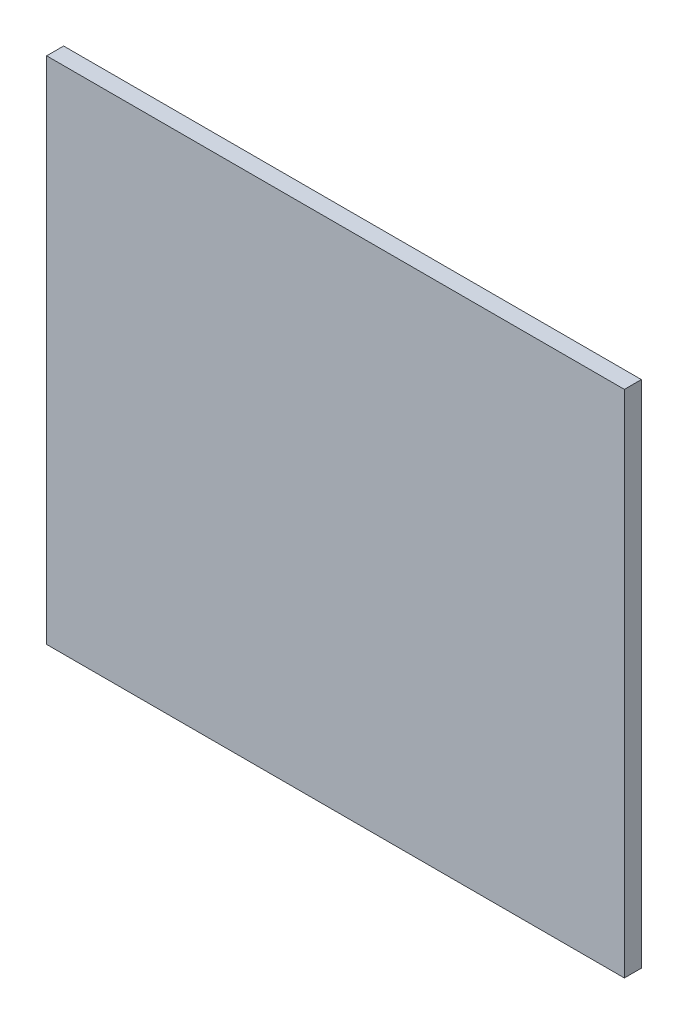
ISO-10303-21;
HEADER;
FILE_DESCRIPTION(('STEP AP214'),'2;1');
FILE_NAME('part.step','',(''),(''),'','','');
FILE_SCHEMA(('AUTOMOTIVE_DESIGN { 1 0 10303 214 1 1 1 1 }'));
ENDSEC;
DATA;
#1=APPLICATION_CONTEXT('core data for automotive mechanical design processes');
#2=APPLICATION_PROTOCOL_DEFINITION('international standard','automotive_design',2000,#1);
#3=PRODUCT_CONTEXT('',#1,'mechanical');
#4=PRODUCT('Part','Part','',(#3));
#5=PRODUCT_RELATED_PRODUCT_CATEGORY('part','',(#4));
#6=PRODUCT_DEFINITION_FORMATION('','',#4);
#7=PRODUCT_DEFINITION_CONTEXT('part definition',#1,'design');
#8=PRODUCT_DEFINITION('design','',#6,#7);
#9=PRODUCT_DEFINITION_SHAPE('','',#8);
#10=(LENGTH_UNIT() NAMED_UNIT(*) SI_UNIT(.MILLI.,.METRE.));
#11=(NAMED_UNIT(*) PLANE_ANGLE_UNIT() SI_UNIT($,.RADIAN.));
#12=(NAMED_UNIT(*) SI_UNIT($,.STERADIAN.) SOLID_ANGLE_UNIT());
#13=UNCERTAINTY_MEASURE_WITH_UNIT(LENGTH_MEASURE(1.E-05),#10,'distance_accuracy_value','');
#14=(GEOMETRIC_REPRESENTATION_CONTEXT(3) GLOBAL_UNCERTAINTY_ASSIGNED_CONTEXT((#13)) GLOBAL_UNIT_ASSIGNED_CONTEXT((#10,
#11,#12)) REPRESENTATION_CONTEXT('',''));
#15=CARTESIAN_POINT('',(0.,0.,0.));
#16=DIRECTION('',(0.,0.,1.));
#17=DIRECTION('',(1.,0.,0.));
#18=AXIS2_PLACEMENT_3D('',#15,#16,#17);
#19=CARTESIAN_POINT('',(85.,75.,5.));
#20=DIRECTION('',(-1.,0.,0.));
#21=DIRECTION('',(0.,-1.,0.));
#22=AXIS2_PLACEMENT_3D('',#19,#20,#21);
#23=PLANE('',#22);
#24=DIRECTION('',(0.,1.,0.));
#25=VECTOR('',#24,1.);
#26=CARTESIAN_POINT('',(85.,75.,0.));
#27=LINE('',#26,#25);
#28=CARTESIAN_POINT('',(85.,-75.,0.));
#29=VERTEX_POINT('',#28);
#30=CARTESIAN_POINT('',(85.,75.,0.));
#31=VERTEX_POINT('',#30);
#32=EDGE_CURVE('E96',#29,#31,#27,.T.);
#33=ORIENTED_EDGE('',*,*,#32,.T.);
#34=DIRECTION('',(0.,0.,-1.));
#35=VECTOR('',#34,1.);
#36=CARTESIAN_POINT('',(85.,75.,5.));
#37=LINE('',#36,#35);
#38=CARTESIAN_POINT('',(85.,75.,5.));
#39=VERTEX_POINT('',#38);
#40=EDGE_CURVE('E11',#39,#31,#37,.T.);
#41=ORIENTED_EDGE('',*,*,#40,.F.);
#42=DIRECTION('',(0.,1.,0.));
#43=VECTOR('',#42,1.);
#44=CARTESIAN_POINT('',(85.,75.,5.));
#45=LINE('',#44,#43);
#46=CARTESIAN_POINT('',(85.,-75.,5.));
#47=VERTEX_POINT('',#46);
#48=EDGE_CURVE('E84',#47,#39,#45,.T.);
#49=ORIENTED_EDGE('',*,*,#48,.F.);
#50=DIRECTION('',(0.,0.,-1.));
#51=VECTOR('',#50,1.);
#52=CARTESIAN_POINT('',(85.,-75.,5.));
#53=LINE('',#52,#51);
#54=EDGE_CURVE('E92',#47,#29,#53,.T.);
#55=ORIENTED_EDGE('',*,*,#54,.T.);
#56=EDGE_LOOP('',(#33,#41,#49,#55));
#57=FACE_BOUND('',#56,.T.);
#58=ADVANCED_FACE('F33',(#57),#23,.F.);
#59=CARTESIAN_POINT('',(-85.,75.,5.));
#60=DIRECTION('',(0.,-1.,0.));
#61=DIRECTION('',(0.,0.,-1.));
#62=AXIS2_PLACEMENT_3D('',#59,#60,#61);
#63=PLANE('',#62);
#64=DIRECTION('',(-1.,0.,0.));
#65=VECTOR('',#64,1.);
#66=CARTESIAN_POINT('',(-85.,75.,0.));
#67=LINE('',#66,#65);
#68=CARTESIAN_POINT('',(-85.,75.,0.));
#69=VERTEX_POINT('',#68);
#70=EDGE_CURVE('E88',#31,#69,#67,.T.);
#71=ORIENTED_EDGE('',*,*,#70,.T.);
#72=DIRECTION('',(0.,0.,-1.));
#73=VECTOR('',#72,1.);
#74=CARTESIAN_POINT('',(-85.,75.,5.));
#75=LINE('',#74,#73);
#76=CARTESIAN_POINT('',(-85.,75.,5.));
#77=VERTEX_POINT('',#76);
#78=EDGE_CURVE('E41',#77,#69,#75,.T.);
#79=ORIENTED_EDGE('',*,*,#78,.F.);
#80=DIRECTION('',(-1.,0.,0.));
#81=VECTOR('',#80,1.);
#82=CARTESIAN_POINT('',(-85.,75.,5.));
#83=LINE('',#82,#81);
#84=EDGE_CURVE('E79',#39,#77,#83,.T.);
#85=ORIENTED_EDGE('',*,*,#84,.F.);
#86=ORIENTED_EDGE('',*,*,#40,.T.);
#87=EDGE_LOOP('',(#71,#79,#85,#86));
#88=FACE_BOUND('',#87,.T.);
#89=ADVANCED_FACE('F87',(#88),#63,.F.);
#90=CARTESIAN_POINT('',(-85.,75.,5.));
#91=DIRECTION('',(1.,0.,0.));
#92=DIRECTION('',(0.,1.,0.));
#93=AXIS2_PLACEMENT_3D('',#90,#91,#92);
#94=PLANE('',#93);
#95=DIRECTION('',(0.,-1.,0.));
#96=VECTOR('',#95,1.);
#97=CARTESIAN_POINT('',(-85.,75.,0.));
#98=LINE('',#97,#96);
#99=CARTESIAN_POINT('',(-85.,-75.,0.));
#100=VERTEX_POINT('',#99);
#101=EDGE_CURVE('E66',#69,#100,#98,.T.);
#102=ORIENTED_EDGE('',*,*,#101,.T.);
#103=DIRECTION('',(0.,0.,-1.));
#104=VECTOR('',#103,1.);
#105=CARTESIAN_POINT('',(-85.,-75.,5.));
#106=LINE('',#105,#104);
#107=CARTESIAN_POINT('',(-85.,-75.,5.));
#108=VERTEX_POINT('',#107);
#109=EDGE_CURVE('E89',#108,#100,#106,.T.);
#110=ORIENTED_EDGE('',*,*,#109,.F.);
#111=DIRECTION('',(0.,-1.,0.));
#112=VECTOR('',#111,1.);
#113=CARTESIAN_POINT('',(-85.,75.,5.));
#114=LINE('',#113,#112);
#115=EDGE_CURVE('E82',#77,#108,#114,.T.);
#116=ORIENTED_EDGE('',*,*,#115,.F.);
#117=ORIENTED_EDGE('',*,*,#78,.T.);
#118=EDGE_LOOP('',(#102,#110,#116,#117));
#119=FACE_BOUND('',#118,.T.);
#120=ADVANCED_FACE('F90',(#119),#94,.F.);
#121=CARTESIAN_POINT('',(-85.,-75.,5.));
#122=DIRECTION('',(0.,1.,0.));
#123=DIRECTION('',(0.,0.,1.));
#124=AXIS2_PLACEMENT_3D('',#121,#122,#123);
#125=PLANE('',#124);
#126=DIRECTION('',(1.,0.,0.));
#127=VECTOR('',#126,1.);
#128=CARTESIAN_POINT('',(-85.,-75.,0.));
#129=LINE('',#128,#127);
#130=EDGE_CURVE('E72',#100,#29,#129,.T.);
#131=ORIENTED_EDGE('',*,*,#130,.T.);
#132=ORIENTED_EDGE('',*,*,#54,.F.);
#133=DIRECTION('',(1.,0.,0.));
#134=VECTOR('',#133,1.);
#135=CARTESIAN_POINT('',(-85.,-75.,5.));
#136=LINE('',#135,#134);
#137=EDGE_CURVE('E49',#108,#47,#136,.T.);
#138=ORIENTED_EDGE('',*,*,#137,.F.);
#139=ORIENTED_EDGE('',*,*,#109,.T.);
#140=EDGE_LOOP('',(#131,#132,#138,#139));
#141=FACE_BOUND('',#140,.T.);
#142=ADVANCED_FACE('F103',(#141),#125,.F.);
#143=CARTESIAN_POINT('',(0.,0.,5.));
#144=DIRECTION('',(0.,0.,1.));
#145=DIRECTION('',(1.,0.,0.));
#146=AXIS2_PLACEMENT_3D('',#143,#144,#145);
#147=PLANE('',#146);
#148=ORIENTED_EDGE('',*,*,#48,.T.);
#149=ORIENTED_EDGE('',*,*,#84,.T.);
#150=ORIENTED_EDGE('',*,*,#115,.T.);
#151=ORIENTED_EDGE('',*,*,#137,.T.);
#152=EDGE_LOOP('',(#148,#149,#150,#151));
#153=FACE_BOUND('',#152,.T.);
#154=ADVANCED_FACE('F80',(#153),#147,.T.);
#155=CARTESIAN_POINT('',(0.,0.,0.));
#156=DIRECTION('',(0.,0.,1.));
#157=DIRECTION('',(1.,0.,0.));
#158=AXIS2_PLACEMENT_3D('',#155,#156,#157);
#159=PLANE('',#158);
#160=ORIENTED_EDGE('',*,*,#32,.F.);
#161=ORIENTED_EDGE('',*,*,#130,.F.);
#162=ORIENTED_EDGE('',*,*,#101,.F.);
#163=ORIENTED_EDGE('',*,*,#70,.F.);
#164=EDGE_LOOP('',(#160,#161,#162,#163));
#165=FACE_BOUND('',#164,.T.);
#166=ADVANCED_FACE('F106',(#165),#159,.F.);
#167=CLOSED_SHELL('',(#58,#89,#120,#142,#154,#166));
#168=MANIFOLD_SOLID_BREP('B2',#167);
#169=ADVANCED_BREP_SHAPE_REPRESENTATION('',(#18,#168),#14);
#170=SHAPE_DEFINITION_REPRESENTATION(#9,#169);
ENDSEC;
END-ISO-10303-21;
